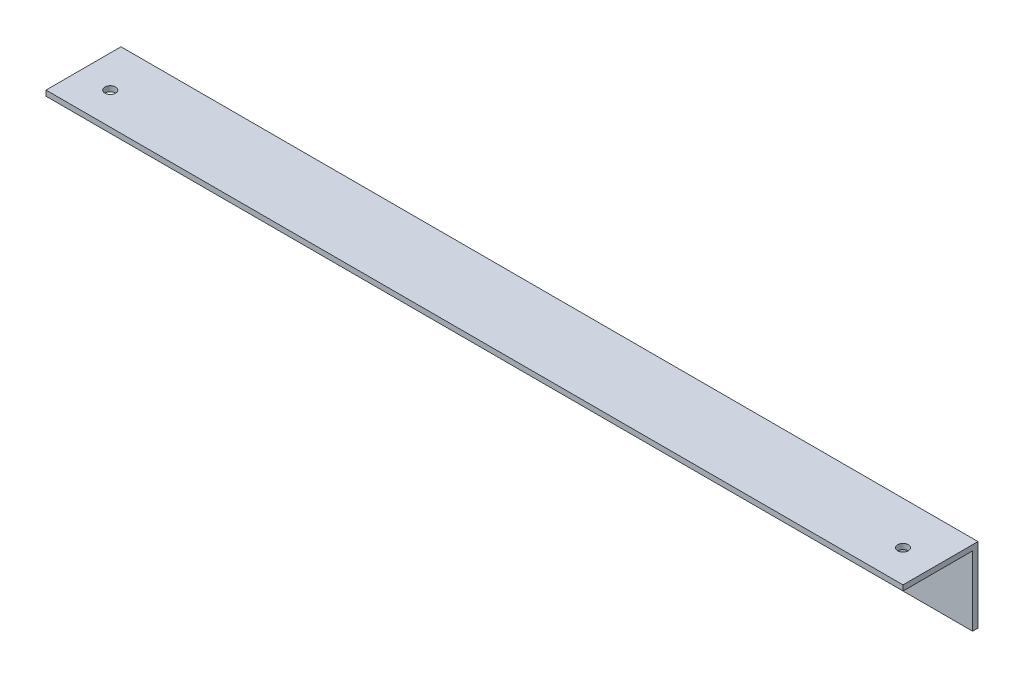
ISO-10303-21;
HEADER;
FILE_DESCRIPTION(('STEP AP214'),'2;1');
FILE_NAME('part.step','',(''),(''),'','','');
FILE_SCHEMA(('AUTOMOTIVE_DESIGN { 1 0 10303 214 1 1 1 1 }'));
ENDSEC;
DATA;
#1=APPLICATION_CONTEXT('core data for automotive mechanical design processes');
#2=APPLICATION_PROTOCOL_DEFINITION('international standard','automotive_design',2000,#1);
#3=PRODUCT_CONTEXT('',#1,'mechanical');
#4=PRODUCT('Part','Part','',(#3));
#5=PRODUCT_RELATED_PRODUCT_CATEGORY('part','',(#4));
#6=PRODUCT_DEFINITION_FORMATION('','',#4);
#7=PRODUCT_DEFINITION_CONTEXT('part definition',#1,'design');
#8=PRODUCT_DEFINITION('design','',#6,#7);
#9=PRODUCT_DEFINITION_SHAPE('','',#8);
#10=(LENGTH_UNIT() NAMED_UNIT(*) SI_UNIT(.MILLI.,.METRE.));
#11=(NAMED_UNIT(*) PLANE_ANGLE_UNIT() SI_UNIT($,.RADIAN.));
#12=(NAMED_UNIT(*) SI_UNIT($,.STERADIAN.) SOLID_ANGLE_UNIT());
#13=UNCERTAINTY_MEASURE_WITH_UNIT(LENGTH_MEASURE(1.E-05),#10,'distance_accuracy_value','');
#14=(GEOMETRIC_REPRESENTATION_CONTEXT(3) GLOBAL_UNCERTAINTY_ASSIGNED_CONTEXT((#13)) GLOBAL_UNIT_ASSIGNED_CONTEXT((#10,
#11,#12)) REPRESENTATION_CONTEXT('',''));
#15=CARTESIAN_POINT('',(0.,0.,0.));
#16=DIRECTION('',(0.,0.,1.));
#17=DIRECTION('',(1.,0.,0.));
#18=AXIS2_PLACEMENT_3D('',#15,#16,#17);
#19=CARTESIAN_POINT('',(19.05,41.275,25.4));
#20=DIRECTION('',(0.,1.,0.));
#21=DIRECTION('',(0.,0.,1.));
#22=AXIS2_PLACEMENT_3D('',#19,#20,#21);
#23=CYLINDRICAL_SURFACE('',#22,3.175);
#24=CARTESIAN_POINT('',(19.05,41.275,25.4));
#25=DIRECTION('',(0.,1.,0.));
#26=DIRECTION('',(0.,0.,1.));
#27=AXIS2_PLACEMENT_3D('',#24,#25,#26);
#28=CIRCLE('',#27,3.175);
#29=CARTESIAN_POINT('',(19.05,41.275,28.575));
#30=VERTEX_POINT('',#29);
#31=EDGE_CURVE('E20',#30,#30,#28,.F.);
#32=ORIENTED_EDGE('',*,*,#31,.T.);
#33=EDGE_LOOP('',(#32));
#34=FACE_BOUND('',#33,.T.);
#35=CARTESIAN_POINT('',(19.05,44.45,25.4));
#36=DIRECTION('',(0.,1.,0.));
#37=DIRECTION('',(0.,0.,1.));
#38=AXIS2_PLACEMENT_3D('',#35,#36,#37);
#39=CIRCLE('',#38,3.175);
#40=CARTESIAN_POINT('',(19.05,44.45,28.575));
#41=VERTEX_POINT('',#40);
#42=EDGE_CURVE('E110',#41,#41,#39,.F.);
#43=ORIENTED_EDGE('',*,*,#42,.F.);
#44=EDGE_LOOP('',(#43));
#45=FACE_BOUND('',#44,.T.);
#46=ADVANCED_FACE('F17',(#34,#45),#23,.F.);
#47=CARTESIAN_POINT('',(488.95,41.275,25.4));
#48=DIRECTION('',(0.,-1.,0.));
#49=DIRECTION('',(0.,0.,-1.));
#50=AXIS2_PLACEMENT_3D('',#47,#48,#49);
#51=CYLINDRICAL_SURFACE('',#50,3.175);
#52=CARTESIAN_POINT('',(488.95,44.45,25.4));
#53=DIRECTION('',(0.,-1.,0.));
#54=DIRECTION('',(0.,0.,-1.));
#55=AXIS2_PLACEMENT_3D('',#52,#53,#54);
#56=CIRCLE('',#55,3.175);
#57=CARTESIAN_POINT('',(488.95,44.45,22.225));
#58=VERTEX_POINT('',#57);
#59=EDGE_CURVE('E106',#58,#58,#56,.T.);
#60=ORIENTED_EDGE('',*,*,#59,.F.);
#61=EDGE_LOOP('',(#60));
#62=FACE_BOUND('',#61,.T.);
#63=CARTESIAN_POINT('',(488.95,41.275,25.4));
#64=DIRECTION('',(0.,-1.,0.));
#65=DIRECTION('',(0.,0.,-1.));
#66=AXIS2_PLACEMENT_3D('',#63,#64,#65);
#67=CIRCLE('',#66,3.175);
#68=CARTESIAN_POINT('',(488.95,41.275,22.225));
#69=VERTEX_POINT('',#68);
#70=EDGE_CURVE('E103',#69,#69,#67,.T.);
#71=ORIENTED_EDGE('',*,*,#70,.T.);
#72=EDGE_LOOP('',(#71));
#73=FACE_BOUND('',#72,.T.);
#74=ADVANCED_FACE('F168',(#62,#73),#51,.F.);
#75=CARTESIAN_POINT('',(0.,0.,3.175));
#76=DIRECTION('',(0.,0.,1.));
#77=DIRECTION('',(1.,0.,0.));
#78=AXIS2_PLACEMENT_3D('',#75,#76,#77);
#79=PLANE('',#78);
#80=DIRECTION('',(0.,1.,0.));
#81=VECTOR('',#80,1.);
#82=CARTESIAN_POINT('',(508.,0.,3.175));
#83=LINE('',#82,#81);
#84=CARTESIAN_POINT('',(508.,41.275,3.175));
#85=VERTEX_POINT('',#84);
#86=CARTESIAN_POINT('',(508.,0.,3.175));
#87=VERTEX_POINT('',#86);
#88=EDGE_CURVE('E77',#85,#87,#83,.F.);
#89=ORIENTED_EDGE('',*,*,#88,.F.);
#90=DIRECTION('',(1.,0.,0.));
#91=VECTOR('',#90,1.);
#92=CARTESIAN_POINT('',(0.,41.275,3.175));
#93=LINE('',#92,#91);
#94=CARTESIAN_POINT('',(0.,41.275,3.175));
#95=VERTEX_POINT('',#94);
#96=EDGE_CURVE('E104',#85,#95,#93,.F.);
#97=ORIENTED_EDGE('',*,*,#96,.T.);
#98=DIRECTION('',(0.,1.,0.));
#99=VECTOR('',#98,1.);
#100=CARTESIAN_POINT('',(0.,44.45,3.175));
#101=LINE('',#100,#99);
#102=CARTESIAN_POINT('',(0.,0.,3.175));
#103=VERTEX_POINT('',#102);
#104=EDGE_CURVE('E78',#103,#95,#101,.T.);
#105=ORIENTED_EDGE('',*,*,#104,.F.);
#106=DIRECTION('',(1.,0.,0.));
#107=VECTOR('',#106,1.);
#108=CARTESIAN_POINT('',(0.,0.,3.175));
#109=LINE('',#108,#107);
#110=EDGE_CURVE('E73',#87,#103,#109,.F.);
#111=ORIENTED_EDGE('',*,*,#110,.F.);
#112=EDGE_LOOP('',(#89,#97,#105,#111));
#113=FACE_BOUND('',#112,.T.);
#114=ADVANCED_FACE('F75',(#113),#79,.T.);
#115=CARTESIAN_POINT('',(0.,41.275,0.));
#116=DIRECTION('',(0.,1.,0.));
#117=DIRECTION('',(0.,0.,1.));
#118=AXIS2_PLACEMENT_3D('',#115,#116,#117);
#119=PLANE('',#118);
#120=ORIENTED_EDGE('',*,*,#70,.F.);
#121=EDGE_LOOP('',(#120));
#122=FACE_BOUND('',#121,.T.);
#123=ORIENTED_EDGE('',*,*,#31,.F.);
#124=EDGE_LOOP('',(#123));
#125=FACE_BOUND('',#124,.T.);
#126=DIRECTION('',(1.,0.,0.));
#127=VECTOR('',#126,1.);
#128=CARTESIAN_POINT('',(0.,41.275,44.45));
#129=LINE('',#128,#127);
#130=CARTESIAN_POINT('',(0.,41.275,44.45));
#131=VERTEX_POINT('',#130);
#132=CARTESIAN_POINT('',(508.,41.275,44.45));
#133=VERTEX_POINT('',#132);
#134=EDGE_CURVE('E67',#131,#133,#129,.T.);
#135=ORIENTED_EDGE('',*,*,#134,.F.);
#136=DIRECTION('',(0.,0.,1.));
#137=VECTOR('',#136,1.);
#138=CARTESIAN_POINT('',(0.,41.275,0.));
#139=LINE('',#138,#137);
#140=EDGE_CURVE('E128',#95,#131,#139,.T.);
#141=ORIENTED_EDGE('',*,*,#140,.F.);
#142=ORIENTED_EDGE('',*,*,#96,.F.);
#143=DIRECTION('',(0.,0.,-1.));
#144=VECTOR('',#143,1.);
#145=CARTESIAN_POINT('',(508.,41.275,0.));
#146=LINE('',#145,#144);
#147=EDGE_CURVE('E91',#133,#85,#146,.T.);
#148=ORIENTED_EDGE('',*,*,#147,.F.);
#149=EDGE_LOOP('',(#135,#141,#142,#148));
#150=FACE_BOUND('',#149,.T.);
#151=ADVANCED_FACE('F121',(#122,#125,#150),#119,.F.);
#152=CARTESIAN_POINT('',(0.,44.45,44.45));
#153=DIRECTION('',(0.,0.,1.));
#154=DIRECTION('',(1.,0.,0.));
#155=AXIS2_PLACEMENT_3D('',#152,#153,#154);
#156=PLANE('',#155);
#157=DIRECTION('',(0.,1.,0.));
#158=VECTOR('',#157,1.);
#159=CARTESIAN_POINT('',(508.,0.,44.45));
#160=LINE('',#159,#158);
#161=CARTESIAN_POINT('',(508.,44.45,44.45));
#162=VERTEX_POINT('',#161);
#163=EDGE_CURVE('E97',#162,#133,#160,.F.);
#164=ORIENTED_EDGE('',*,*,#163,.F.);
#165=DIRECTION('',(1.,0.,0.));
#166=VECTOR('',#165,1.);
#167=CARTESIAN_POINT('',(508.,44.45,44.45));
#168=LINE('',#167,#166);
#169=CARTESIAN_POINT('',(0.,44.45,44.45));
#170=VERTEX_POINT('',#169);
#171=EDGE_CURVE('E92',#170,#162,#168,.T.);
#172=ORIENTED_EDGE('',*,*,#171,.F.);
#173=DIRECTION('',(0.,1.,0.));
#174=VECTOR('',#173,1.);
#175=CARTESIAN_POINT('',(0.,44.45,44.45));
#176=LINE('',#175,#174);
#177=EDGE_CURVE('E130',#131,#170,#176,.T.);
#178=ORIENTED_EDGE('',*,*,#177,.F.);
#179=ORIENTED_EDGE('',*,*,#134,.T.);
#180=EDGE_LOOP('',(#164,#172,#178,#179));
#181=FACE_BOUND('',#180,.T.);
#182=ADVANCED_FACE('F124',(#181),#156,.T.);
#183=CARTESIAN_POINT('',(0.,0.,0.));
#184=DIRECTION('',(0.,-1.,0.));
#185=DIRECTION('',(0.,0.,-1.));
#186=AXIS2_PLACEMENT_3D('',#183,#184,#185);
#187=PLANE('',#186);
#188=DIRECTION('',(0.,0.,1.));
#189=VECTOR('',#188,1.);
#190=CARTESIAN_POINT('',(0.,0.,0.));
#191=LINE('',#190,#189);
#192=CARTESIAN_POINT('',(0.,0.,0.));
#193=VERTEX_POINT('',#192);
#194=EDGE_CURVE('E109',#193,#103,#191,.T.);
#195=ORIENTED_EDGE('',*,*,#194,.F.);
#196=DIRECTION('',(1.,0.,0.));
#197=VECTOR('',#196,1.);
#198=CARTESIAN_POINT('',(0.,0.,0.));
#199=LINE('',#198,#197);
#200=CARTESIAN_POINT('',(508.,0.,0.));
#201=VERTEX_POINT('',#200);
#202=EDGE_CURVE('E96',#193,#201,#199,.T.);
#203=ORIENTED_EDGE('',*,*,#202,.T.);
#204=DIRECTION('',(0.,0.,-1.));
#205=VECTOR('',#204,1.);
#206=CARTESIAN_POINT('',(508.,0.,0.));
#207=LINE('',#206,#205);
#208=EDGE_CURVE('E83',#87,#201,#207,.T.);
#209=ORIENTED_EDGE('',*,*,#208,.F.);
#210=ORIENTED_EDGE('',*,*,#110,.T.);
#211=EDGE_LOOP('',(#195,#203,#209,#210));
#212=FACE_BOUND('',#211,.T.);
#213=ADVANCED_FACE('F95',(#212),#187,.T.);
#214=CARTESIAN_POINT('',(508.,0.,0.));
#215=DIRECTION('',(1.,0.,0.));
#216=DIRECTION('',(0.,0.,-1.));
#217=AXIS2_PLACEMENT_3D('',#214,#215,#216);
#218=PLANE('',#217);
#219=ORIENTED_EDGE('',*,*,#147,.T.);
#220=ORIENTED_EDGE('',*,*,#88,.T.);
#221=ORIENTED_EDGE('',*,*,#208,.T.);
#222=DIRECTION('',(0.,1.,0.));
#223=VECTOR('',#222,1.);
#224=CARTESIAN_POINT('',(508.,0.,0.));
#225=LINE('',#224,#223);
#226=CARTESIAN_POINT('',(508.,44.45,0.));
#227=VERTEX_POINT('',#226);
#228=EDGE_CURVE('E144',#201,#227,#225,.T.);
#229=ORIENTED_EDGE('',*,*,#228,.T.);
#230=DIRECTION('',(0.,0.,1.));
#231=VECTOR('',#230,1.);
#232=CARTESIAN_POINT('',(508.,44.45,0.));
#233=LINE('',#232,#231);
#234=EDGE_CURVE('E112',#162,#227,#233,.F.);
#235=ORIENTED_EDGE('',*,*,#234,.F.);
#236=ORIENTED_EDGE('',*,*,#163,.T.);
#237=EDGE_LOOP('',(#219,#220,#221,#229,#235,#236));
#238=FACE_BOUND('',#237,.T.);
#239=ADVANCED_FACE('F87',(#238),#218,.T.);
#240=CARTESIAN_POINT('',(508.,44.45,0.));
#241=DIRECTION('',(0.,1.,0.));
#242=DIRECTION('',(0.,0.,1.));
#243=AXIS2_PLACEMENT_3D('',#240,#241,#242);
#244=PLANE('',#243);
#245=ORIENTED_EDGE('',*,*,#59,.T.);
#246=EDGE_LOOP('',(#245));
#247=FACE_BOUND('',#246,.T.);
#248=ORIENTED_EDGE('',*,*,#42,.T.);
#249=EDGE_LOOP('',(#248));
#250=FACE_BOUND('',#249,.T.);
#251=ORIENTED_EDGE('',*,*,#171,.T.);
#252=ORIENTED_EDGE('',*,*,#234,.T.);
#253=DIRECTION('',(1.,0.,0.));
#254=VECTOR('',#253,1.);
#255=CARTESIAN_POINT('',(0.,44.45,0.));
#256=LINE('',#255,#254);
#257=CARTESIAN_POINT('',(0.,44.45,0.));
#258=VERTEX_POINT('',#257);
#259=EDGE_CURVE('E26',#227,#258,#256,.F.);
#260=ORIENTED_EDGE('',*,*,#259,.T.);
#261=DIRECTION('',(0.,0.,1.));
#262=VECTOR('',#261,1.);
#263=CARTESIAN_POINT('',(0.,44.45,0.));
#264=LINE('',#263,#262);
#265=EDGE_CURVE('E34',#170,#258,#264,.F.);
#266=ORIENTED_EDGE('',*,*,#265,.F.);
#267=EDGE_LOOP('',(#251,#252,#260,#266));
#268=FACE_BOUND('',#267,.T.);
#269=ADVANCED_FACE('F140',(#247,#250,#268),#244,.T.);
#270=CARTESIAN_POINT('',(0.,44.45,0.));
#271=DIRECTION('',(-1.,0.,0.));
#272=DIRECTION('',(0.,0.,1.));
#273=AXIS2_PLACEMENT_3D('',#270,#271,#272);
#274=PLANE('',#273);
#275=ORIENTED_EDGE('',*,*,#177,.T.);
#276=ORIENTED_EDGE('',*,*,#265,.T.);
#277=DIRECTION('',(0.,1.,0.));
#278=VECTOR('',#277,1.);
#279=CARTESIAN_POINT('',(0.,0.,0.));
#280=LINE('',#279,#278);
#281=EDGE_CURVE('E11',#258,#193,#280,.F.);
#282=ORIENTED_EDGE('',*,*,#281,.T.);
#283=ORIENTED_EDGE('',*,*,#194,.T.);
#284=ORIENTED_EDGE('',*,*,#104,.T.);
#285=ORIENTED_EDGE('',*,*,#140,.T.);
#286=EDGE_LOOP('',(#275,#276,#282,#283,#284,#285));
#287=FACE_BOUND('',#286,.T.);
#288=ADVANCED_FACE('F149',(#287),#274,.T.);
#289=CARTESIAN_POINT('',(0.,0.,0.));
#290=DIRECTION('',(0.,0.,1.));
#291=DIRECTION('',(1.,0.,0.));
#292=AXIS2_PLACEMENT_3D('',#289,#290,#291);
#293=PLANE('',#292);
#294=ORIENTED_EDGE('',*,*,#259,.F.);
#295=ORIENTED_EDGE('',*,*,#228,.F.);
#296=ORIENTED_EDGE('',*,*,#202,.F.);
#297=ORIENTED_EDGE('',*,*,#281,.F.);
#298=EDGE_LOOP('',(#294,#295,#296,#297));
#299=FACE_BOUND('',#298,.T.);
#300=ADVANCED_FACE('F148',(#299),#293,.F.);
#301=CLOSED_SHELL('',(#46,#74,#114,#151,#182,#213,#239,#269,#288,#300));
#302=MANIFOLD_SOLID_BREP('B1',#301);
#303=ADVANCED_BREP_SHAPE_REPRESENTATION('',(#18,#302),#14);
#304=SHAPE_DEFINITION_REPRESENTATION(#9,#303);
ENDSEC;
END-ISO-10303-21;
